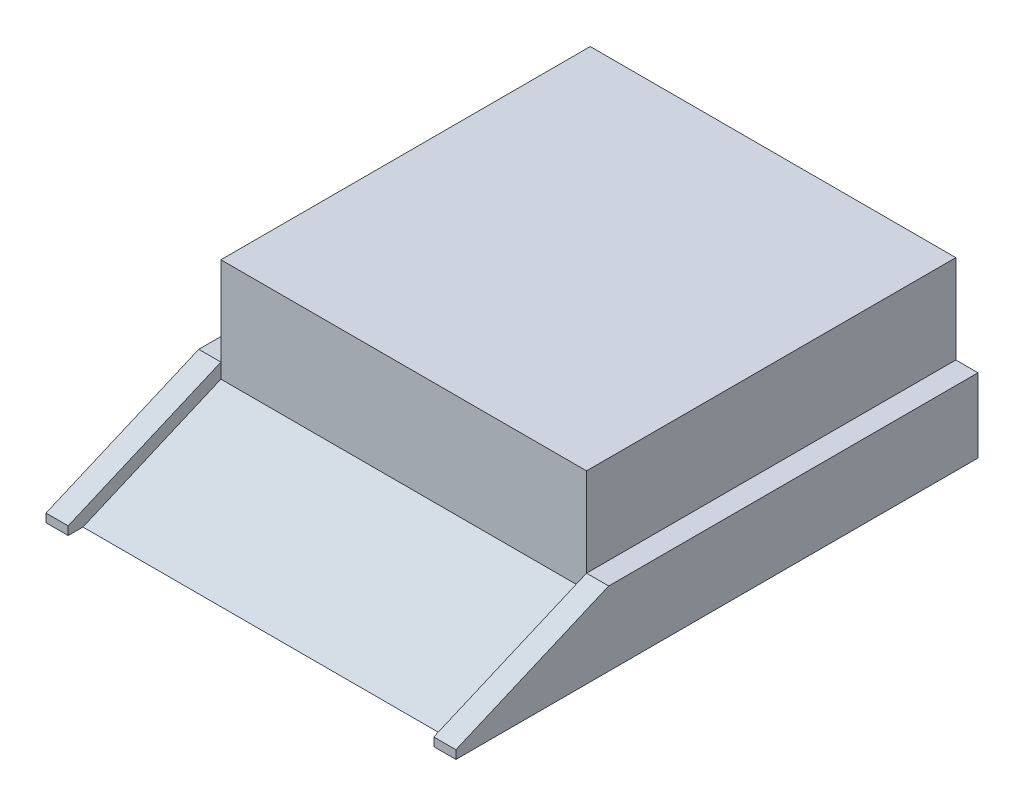
ISO-10303-21;
HEADER;
FILE_DESCRIPTION(('STEP AP214'),'2;1');
FILE_NAME('part.step','',(''),(''),'','','');
FILE_SCHEMA(('AUTOMOTIVE_DESIGN { 1 0 10303 214 1 1 1 1 }'));
ENDSEC;
DATA;
#1=APPLICATION_CONTEXT('core data for automotive mechanical design processes');
#2=APPLICATION_PROTOCOL_DEFINITION('international standard','automotive_design',2000,#1);
#3=PRODUCT_CONTEXT('',#1,'mechanical');
#4=PRODUCT('Part','Part','',(#3));
#5=PRODUCT_RELATED_PRODUCT_CATEGORY('part','',(#4));
#6=PRODUCT_DEFINITION_FORMATION('','',#4);
#7=PRODUCT_DEFINITION_CONTEXT('part definition',#1,'design');
#8=PRODUCT_DEFINITION('design','',#6,#7);
#9=PRODUCT_DEFINITION_SHAPE('','',#8);
#10=(LENGTH_UNIT() NAMED_UNIT(*) SI_UNIT(.MILLI.,.METRE.));
#11=(NAMED_UNIT(*) PLANE_ANGLE_UNIT() SI_UNIT($,.RADIAN.));
#12=(NAMED_UNIT(*) SI_UNIT($,.STERADIAN.) SOLID_ANGLE_UNIT());
#13=UNCERTAINTY_MEASURE_WITH_UNIT(LENGTH_MEASURE(1.E-05),#10,'distance_accuracy_value','');
#14=(GEOMETRIC_REPRESENTATION_CONTEXT(3) GLOBAL_UNCERTAINTY_ASSIGNED_CONTEXT((#13)) GLOBAL_UNIT_ASSIGNED_CONTEXT((#10,
#11,#12)) REPRESENTATION_CONTEXT('',''));
#15=CARTESIAN_POINT('',(0.,0.,0.));
#16=DIRECTION('',(0.,0.,1.));
#17=DIRECTION('',(1.,0.,0.));
#18=AXIS2_PLACEMENT_3D('',#15,#16,#17);
#19=CARTESIAN_POINT('',(-1237.5,0.,0.));
#20=DIRECTION('',(1.,0.,0.));
#21=DIRECTION('',(0.,0.,-1.));
#22=AXIS2_PLACEMENT_3D('',#19,#20,#21);
#23=PLANE('',#22);
#24=DIRECTION('',(0.,-0.393681718866985,0.91924681355441));
#25=VECTOR('',#24,1.);
#26=CARTESIAN_POINT('',(-1237.5,603.271739593706,258.360488048696));
#27=LINE('',#26,#25);
#28=CARTESIAN_POINT('',(-1237.5,400.,733.));
#29=VERTEX_POINT('',#28);
#30=CARTESIAN_POINT('',(-1237.5,0.,1667.));
#31=VERTEX_POINT('',#30);
#32=EDGE_CURVE('E162',#29,#31,#27,.T.);
#33=ORIENTED_EDGE('',*,*,#32,.F.);
#34=DIRECTION('',(0.,-1.,0.));
#35=VECTOR('',#34,1.);
#36=CARTESIAN_POINT('',(-1237.5,1100.,733.));
#37=LINE('',#36,#35);
#38=CARTESIAN_POINT('',(-1237.5,500.,733.));
#39=VERTEX_POINT('',#38);
#40=EDGE_CURVE('E154',#39,#29,#37,.T.);
#41=ORIENTED_EDGE('',*,*,#40,.F.);
#42=DIRECTION('',(0.,-0.393681718866985,0.91924681355441));
#43=VECTOR('',#42,1.);
#44=CARTESIAN_POINT('',(-1237.5,687.7732100167,294.549554611006));
#45=LINE('',#44,#43);
#46=CARTESIAN_POINT('',(-1237.5,57.1734475374734,1767.));
#47=VERTEX_POINT('',#46);
#48=EDGE_CURVE('E166',#39,#47,#45,.T.);
#49=ORIENTED_EDGE('',*,*,#48,.T.);
#50=DIRECTION('',(0.,-1.,0.));
#51=VECTOR('',#50,1.);
#52=CARTESIAN_POINT('',(-1237.5,0.,1767.));
#53=LINE('',#52,#51);
#54=CARTESIAN_POINT('',(-1237.5,0.,1767.));
#55=VERTEX_POINT('',#54);
#56=EDGE_CURVE('E168',#47,#55,#53,.T.);
#57=ORIENTED_EDGE('',*,*,#56,.T.);
#58=DIRECTION('',(0.,0.,-1.));
#59=VECTOR('',#58,1.);
#60=CARTESIAN_POINT('',(-1237.5,0.,0.));
#61=LINE('',#60,#59);
#62=EDGE_CURVE('E170',#55,#31,#61,.T.);
#63=ORIENTED_EDGE('',*,*,#62,.T.);
#64=EDGE_LOOP('',(#33,#41,#49,#57,#63));
#65=FACE_BOUND('',#64,.T.);
#66=ADVANCED_FACE('F34',(#65),#23,.T.);
#67=CARTESIAN_POINT('',(1237.5,0.,0.));
#68=DIRECTION('',(1.,0.,0.));
#69=DIRECTION('',(0.,0.,-1.));
#70=AXIS2_PLACEMENT_3D('',#67,#68,#69);
#71=PLANE('',#70);
#72=DIRECTION('',(0.,1.,0.));
#73=VECTOR('',#72,1.);
#74=CARTESIAN_POINT('',(1237.5,0.,733.));
#75=LINE('',#74,#73);
#76=CARTESIAN_POINT('',(1237.5,400.,733.));
#77=VERTEX_POINT('',#76);
#78=CARTESIAN_POINT('',(1237.5,500.,733.));
#79=VERTEX_POINT('',#78);
#80=EDGE_CURVE('E11',#77,#79,#75,.T.);
#81=ORIENTED_EDGE('',*,*,#80,.F.);
#82=DIRECTION('',(0.,-0.393681718866985,0.91924681355441));
#83=VECTOR('',#82,1.);
#84=CARTESIAN_POINT('',(1237.5,603.271739593706,258.360488048696));
#85=LINE('',#84,#83);
#86=CARTESIAN_POINT('',(1237.5,0.,1667.));
#87=VERTEX_POINT('',#86);
#88=EDGE_CURVE('E153',#77,#87,#85,.T.);
#89=ORIENTED_EDGE('',*,*,#88,.T.);
#90=DIRECTION('',(0.,0.,-1.));
#91=VECTOR('',#90,1.);
#92=CARTESIAN_POINT('',(1237.5,0.,0.));
#93=LINE('',#92,#91);
#94=CARTESIAN_POINT('',(1237.5,0.,1767.));
#95=VERTEX_POINT('',#94);
#96=EDGE_CURVE('E164',#95,#87,#93,.T.);
#97=ORIENTED_EDGE('',*,*,#96,.F.);
#98=DIRECTION('',(0.,-1.,0.));
#99=VECTOR('',#98,1.);
#100=CARTESIAN_POINT('',(1237.5,0.,1767.));
#101=LINE('',#100,#99);
#102=CARTESIAN_POINT('',(1237.5,57.1734475374734,1767.));
#103=VERTEX_POINT('',#102);
#104=EDGE_CURVE('E49',#103,#95,#101,.T.);
#105=ORIENTED_EDGE('',*,*,#104,.F.);
#106=DIRECTION('',(0.,-0.393681718866985,0.91924681355441));
#107=VECTOR('',#106,1.);
#108=CARTESIAN_POINT('',(1237.5,687.7732100167,294.549554611006));
#109=LINE('',#108,#107);
#110=EDGE_CURVE('E175',#79,#103,#109,.T.);
#111=ORIENTED_EDGE('',*,*,#110,.F.);
#112=EDGE_LOOP('',(#81,#89,#97,#105,#111));
#113=FACE_BOUND('',#112,.T.);
#114=ADVANCED_FACE('F258',(#113),#71,.F.);
#115=CARTESIAN_POINT('',(-1387.5,500.,1767.));
#116=DIRECTION('',(0.,0.,-1.));
#117=DIRECTION('',(-1.,0.,0.));
#118=AXIS2_PLACEMENT_3D('',#115,#116,#117);
#119=PLANE('',#118);
#120=ORIENTED_EDGE('',*,*,#56,.F.);
#121=DIRECTION('',(1.,0.,0.));
#122=VECTOR('',#121,1.);
#123=CARTESIAN_POINT('',(-1387.5,57.1734475374734,1767.));
#124=LINE('',#123,#122);
#125=CARTESIAN_POINT('',(-1387.5,57.1734475374734,1767.));
#126=VERTEX_POINT('',#125);
#127=EDGE_CURVE('E188',#126,#47,#124,.T.);
#128=ORIENTED_EDGE('',*,*,#127,.F.);
#129=DIRECTION('',(0.,-1.,0.));
#130=VECTOR('',#129,1.);
#131=CARTESIAN_POINT('',(-1387.5,500.,1767.));
#132=LINE('',#131,#130);
#133=CARTESIAN_POINT('',(-1387.5,0.,1767.));
#134=VERTEX_POINT('',#133);
#135=EDGE_CURVE('E219',#126,#134,#132,.T.);
#136=ORIENTED_EDGE('',*,*,#135,.T.);
#137=DIRECTION('',(1.,0.,0.));
#138=VECTOR('',#137,1.);
#139=CARTESIAN_POINT('',(-1387.5,0.,1767.));
#140=LINE('',#139,#138);
#141=EDGE_CURVE('E199',#134,#55,#140,.T.);
#142=ORIENTED_EDGE('',*,*,#141,.T.);
#143=EDGE_LOOP('',(#120,#128,#136,#142));
#144=FACE_BOUND('',#143,.T.);
#145=ADVANCED_FACE('F256',(#144),#119,.F.);
#146=CARTESIAN_POINT('',(0.,500.,0.));
#147=DIRECTION('',(0.,1.,0.));
#148=DIRECTION('',(0.,0.,1.));
#149=AXIS2_PLACEMENT_3D('',#146,#147,#148);
#150=PLANE('',#149);
#151=DIRECTION('',(1.,0.,0.));
#152=VECTOR('',#151,1.);
#153=CARTESIAN_POINT('',(-1387.5,500.,733.));
#154=LINE('',#153,#152);
#155=CARTESIAN_POINT('',(-1387.5,500.,733.));
#156=VERTEX_POINT('',#155);
#157=EDGE_CURVE('E193',#156,#39,#154,.T.);
#158=ORIENTED_EDGE('',*,*,#157,.T.);
#159=DIRECTION('',(0.,0.,1.));
#160=VECTOR('',#159,1.);
#161=CARTESIAN_POINT('',(-1237.5,500.,0.));
#162=LINE('',#161,#160);
#163=CARTESIAN_POINT('',(-1237.5,500.,-1767.));
#164=VERTEX_POINT('',#163);
#165=EDGE_CURVE('E152',#164,#39,#162,.T.);
#166=ORIENTED_EDGE('',*,*,#165,.F.);
#167=DIRECTION('',(-1.,0.,0.));
#168=VECTOR('',#167,1.);
#169=CARTESIAN_POINT('',(-1387.5,500.,-1767.));
#170=LINE('',#169,#168);
#171=CARTESIAN_POINT('',(-1387.5,500.,-1767.));
#172=VERTEX_POINT('',#171);
#173=EDGE_CURVE('E198',#164,#172,#170,.T.);
#174=ORIENTED_EDGE('',*,*,#173,.T.);
#175=DIRECTION('',(0.,0.,1.));
#176=VECTOR('',#175,1.);
#177=CARTESIAN_POINT('',(-1387.5,500.,-1767.));
#178=LINE('',#177,#176);
#179=EDGE_CURVE('E203',#172,#156,#178,.T.);
#180=ORIENTED_EDGE('',*,*,#179,.T.);
#181=EDGE_LOOP('',(#158,#166,#174,#180));
#182=FACE_BOUND('',#181,.T.);
#183=ADVANCED_FACE('F247',(#182),#150,.T.);
#184=CARTESIAN_POINT('',(-1387.5,500.,-1767.));
#185=DIRECTION('',(0.,0.,1.));
#186=DIRECTION('',(1.,0.,0.));
#187=AXIS2_PLACEMENT_3D('',#184,#185,#186);
#188=PLANE('',#187);
#189=DIRECTION('',(-1.,0.,0.));
#190=VECTOR('',#189,1.);
#191=CARTESIAN_POINT('',(-1387.5,0.,-1767.));
#192=LINE('',#191,#190);
#193=CARTESIAN_POINT('',(1387.5,0.,-1767.));
#194=VERTEX_POINT('',#193);
#195=CARTESIAN_POINT('',(-1387.5,0.,-1767.));
#196=VERTEX_POINT('',#195);
#197=EDGE_CURVE('E209',#194,#196,#192,.T.);
#198=ORIENTED_EDGE('',*,*,#197,.T.);
#199=DIRECTION('',(0.,-1.,0.));
#200=VECTOR('',#199,1.);
#201=CARTESIAN_POINT('',(-1387.5,500.,-1767.));
#202=LINE('',#201,#200);
#203=EDGE_CURVE('E221',#172,#196,#202,.T.);
#204=ORIENTED_EDGE('',*,*,#203,.F.);
#205=ORIENTED_EDGE('',*,*,#173,.F.);
#206=DIRECTION('',(0.,-1.,0.));
#207=VECTOR('',#206,1.);
#208=CARTESIAN_POINT('',(-1237.5,1100.,-1767.));
#209=LINE('',#208,#207);
#210=CARTESIAN_POINT('',(-1237.5,1100.,-1767.));
#211=VERTEX_POINT('',#210);
#212=EDGE_CURVE('E245',#211,#164,#209,.T.);
#213=ORIENTED_EDGE('',*,*,#212,.F.);
#214=DIRECTION('',(-1.,0.,0.));
#215=VECTOR('',#214,1.);
#216=CARTESIAN_POINT('',(0.,1100.,-1767.));
#217=LINE('',#216,#215);
#218=CARTESIAN_POINT('',(1237.5,1100.,-1767.));
#219=VERTEX_POINT('',#218);
#220=EDGE_CURVE('E146',#219,#211,#217,.T.);
#221=ORIENTED_EDGE('',*,*,#220,.F.);
#222=DIRECTION('',(0.,-1.,0.));
#223=VECTOR('',#222,1.);
#224=CARTESIAN_POINT('',(1237.5,1100.,-1767.));
#225=LINE('',#224,#223);
#226=CARTESIAN_POINT('',(1237.5,500.,-1767.));
#227=VERTEX_POINT('',#226);
#228=EDGE_CURVE('E366',#219,#227,#225,.T.);
#229=ORIENTED_EDGE('',*,*,#228,.T.);
#230=CARTESIAN_POINT('',(1387.5,500.,-1767.));
#231=VERTEX_POINT('',#230);
#232=EDGE_CURVE('E200',#231,#227,#170,.T.);
#233=ORIENTED_EDGE('',*,*,#232,.F.);
#234=DIRECTION('',(0.,-1.,0.));
#235=VECTOR('',#234,1.);
#236=CARTESIAN_POINT('',(1387.5,500.,-1767.));
#237=LINE('',#236,#235);
#238=EDGE_CURVE('E42',#231,#194,#237,.T.);
#239=ORIENTED_EDGE('',*,*,#238,.T.);
#240=EDGE_LOOP('',(#198,#204,#205,#213,#221,#229,#233,#239));
#241=FACE_BOUND('',#240,.T.);
#242=ADVANCED_FACE('F227',(#241),#188,.F.);
#243=CARTESIAN_POINT('',(0.,0.,0.));
#244=DIRECTION('',(0.,1.,0.));
#245=DIRECTION('',(0.,0.,1.));
#246=AXIS2_PLACEMENT_3D('',#243,#244,#245);
#247=PLANE('',#246);
#248=DIRECTION('',(0.,0.,1.));
#249=VECTOR('',#248,1.);
#250=CARTESIAN_POINT('',(-1387.5,0.,-1767.));
#251=LINE('',#250,#249);
#252=EDGE_CURVE('E211',#196,#134,#251,.T.);
#253=ORIENTED_EDGE('',*,*,#252,.F.);
#254=ORIENTED_EDGE('',*,*,#197,.F.);
#255=DIRECTION('',(0.,0.,-1.));
#256=VECTOR('',#255,1.);
#257=CARTESIAN_POINT('',(1387.5,0.,-1767.));
#258=LINE('',#257,#256);
#259=CARTESIAN_POINT('',(1387.5,0.,1767.));
#260=VERTEX_POINT('',#259);
#261=EDGE_CURVE('E191',#260,#194,#258,.T.);
#262=ORIENTED_EDGE('',*,*,#261,.F.);
#263=EDGE_CURVE('E214',#95,#260,#140,.T.);
#264=ORIENTED_EDGE('',*,*,#263,.F.);
#265=ORIENTED_EDGE('',*,*,#96,.T.);
#266=DIRECTION('',(1.,0.,0.));
#267=VECTOR('',#266,1.);
#268=CARTESIAN_POINT('',(-1237.5,0.,1667.));
#269=LINE('',#268,#267);
#270=EDGE_CURVE('E180',#31,#87,#269,.T.);
#271=ORIENTED_EDGE('',*,*,#270,.F.);
#272=ORIENTED_EDGE('',*,*,#62,.F.);
#273=ORIENTED_EDGE('',*,*,#141,.F.);
#274=EDGE_LOOP('',(#253,#254,#262,#264,#265,#271,#272,#273));
#275=FACE_BOUND('',#274,.T.);
#276=ADVANCED_FACE('F236',(#275),#247,.F.);
#277=CARTESIAN_POINT('',(-1387.5,687.7732100167,294.549554611006));
#278=DIRECTION('',(0.,0.91924681355441,0.393681718866985));
#279=DIRECTION('',(0.,-0.393681718866985,0.91924681355441));
#280=AXIS2_PLACEMENT_3D('',#277,#278,#279);
#281=PLANE('',#280);
#282=ORIENTED_EDGE('',*,*,#127,.T.);
#283=ORIENTED_EDGE('',*,*,#48,.F.);
#284=ORIENTED_EDGE('',*,*,#157,.F.);
#285=DIRECTION('',(0.,-0.393681718866985,0.91924681355441));
#286=VECTOR('',#285,1.);
#287=CARTESIAN_POINT('',(-1387.5,687.7732100167,294.549554611006));
#288=LINE('',#287,#286);
#289=EDGE_CURVE('E184',#156,#126,#288,.T.);
#290=ORIENTED_EDGE('',*,*,#289,.T.);
#291=EDGE_LOOP('',(#282,#283,#284,#290));
#292=FACE_BOUND('',#291,.T.);
#293=ADVANCED_FACE('F250',(#292),#281,.T.);
#294=CARTESIAN_POINT('',(1387.5,500.,-1767.));
#295=DIRECTION('',(-1.,0.,0.));
#296=DIRECTION('',(0.,0.,1.));
#297=AXIS2_PLACEMENT_3D('',#294,#295,#296);
#298=PLANE('',#297);
#299=DIRECTION('',(0.,-0.393681718866985,0.91924681355441));
#300=VECTOR('',#299,1.);
#301=CARTESIAN_POINT('',(1387.5,687.7732100167,294.549554611006));
#302=LINE('',#301,#300);
#303=CARTESIAN_POINT('',(1387.5,500.,733.));
#304=VERTEX_POINT('',#303);
#305=CARTESIAN_POINT('',(1387.5,57.1734475374734,1767.));
#306=VERTEX_POINT('',#305);
#307=EDGE_CURVE('E182',#304,#306,#302,.T.);
#308=ORIENTED_EDGE('',*,*,#307,.T.);
#309=DIRECTION('',(0.,-1.,0.));
#310=VECTOR('',#309,1.);
#311=CARTESIAN_POINT('',(1387.5,500.,1767.));
#312=LINE('',#311,#310);
#313=EDGE_CURVE('E206',#306,#260,#312,.T.);
#314=ORIENTED_EDGE('',*,*,#313,.T.);
#315=ORIENTED_EDGE('',*,*,#261,.T.);
#316=ORIENTED_EDGE('',*,*,#238,.F.);
#317=DIRECTION('',(0.,0.,-1.));
#318=VECTOR('',#317,1.);
#319=CARTESIAN_POINT('',(1387.5,500.,-1767.));
#320=LINE('',#319,#318);
#321=EDGE_CURVE('E196',#304,#231,#320,.T.);
#322=ORIENTED_EDGE('',*,*,#321,.F.);
#323=EDGE_LOOP('',(#308,#314,#315,#316,#322));
#324=FACE_BOUND('',#323,.T.);
#325=ADVANCED_FACE('F36',(#324),#298,.F.);
#326=CARTESIAN_POINT('',(-1387.5,500.,-1767.));
#327=DIRECTION('',(1.,0.,0.));
#328=DIRECTION('',(0.,0.,-1.));
#329=AXIS2_PLACEMENT_3D('',#326,#327,#328);
#330=PLANE('',#329);
#331=ORIENTED_EDGE('',*,*,#289,.F.);
#332=ORIENTED_EDGE('',*,*,#179,.F.);
#333=ORIENTED_EDGE('',*,*,#203,.T.);
#334=ORIENTED_EDGE('',*,*,#252,.T.);
#335=ORIENTED_EDGE('',*,*,#135,.F.);
#336=EDGE_LOOP('',(#331,#332,#333,#334,#335));
#337=FACE_BOUND('',#336,.T.);
#338=ADVANCED_FACE('F242',(#337),#330,.F.);
#339=EDGE_CURVE('E192',#103,#306,#124,.T.);
#340=ORIENTED_EDGE('',*,*,#339,.F.);
#341=ORIENTED_EDGE('',*,*,#104,.T.);
#342=ORIENTED_EDGE('',*,*,#263,.T.);
#343=ORIENTED_EDGE('',*,*,#313,.F.);
#344=EDGE_LOOP('',(#340,#341,#342,#343));
#345=FACE_BOUND('',#344,.T.);
#346=ADVANCED_FACE('F260',(#345),#119,.F.);
#347=DIRECTION('',(0.,0.,1.));
#348=VECTOR('',#347,1.);
#349=CARTESIAN_POINT('',(1237.5,500.,0.));
#350=LINE('',#349,#348);
#351=EDGE_CURVE('E157',#227,#79,#350,.T.);
#352=ORIENTED_EDGE('',*,*,#351,.T.);
#353=EDGE_CURVE('E57',#79,#304,#154,.T.);
#354=ORIENTED_EDGE('',*,*,#353,.T.);
#355=ORIENTED_EDGE('',*,*,#321,.T.);
#356=ORIENTED_EDGE('',*,*,#232,.T.);
#357=EDGE_LOOP('',(#352,#354,#355,#356));
#358=FACE_BOUND('',#357,.T.);
#359=ADVANCED_FACE('F266',(#358),#150,.T.);
#360=ORIENTED_EDGE('',*,*,#110,.T.);
#361=ORIENTED_EDGE('',*,*,#339,.T.);
#362=ORIENTED_EDGE('',*,*,#307,.F.);
#363=ORIENTED_EDGE('',*,*,#353,.F.);
#364=EDGE_LOOP('',(#360,#361,#362,#363));
#365=FACE_BOUND('',#364,.T.);
#366=ADVANCED_FACE('F282',(#365),#281,.T.);
#367=CARTESIAN_POINT('',(-1237.5,603.271739593706,258.360488048696));
#368=DIRECTION('',(0.,0.91924681355441,0.393681718866985));
#369=DIRECTION('',(0.,-0.393681718866985,0.91924681355441));
#370=AXIS2_PLACEMENT_3D('',#367,#368,#369);
#371=PLANE('',#370);
#372=ORIENTED_EDGE('',*,*,#88,.F.);
#373=DIRECTION('',(1.,0.,0.));
#374=VECTOR('',#373,1.);
#375=CARTESIAN_POINT('',(-1237.5,400.,733.));
#376=LINE('',#375,#374);
#377=EDGE_CURVE('E172',#29,#77,#376,.T.);
#378=ORIENTED_EDGE('',*,*,#377,.F.);
#379=ORIENTED_EDGE('',*,*,#32,.T.);
#380=ORIENTED_EDGE('',*,*,#270,.T.);
#381=EDGE_LOOP('',(#372,#378,#379,#380));
#382=FACE_BOUND('',#381,.T.);
#383=ADVANCED_FACE('F279',(#382),#371,.T.);
#384=CARTESIAN_POINT('',(-1237.5,1100.,1.35693925231964E-13));
#385=DIRECTION('',(1.,0.,0.));
#386=DIRECTION('',(0.,0.,-1.));
#387=AXIS2_PLACEMENT_3D('',#384,#385,#386);
#388=PLANE('',#387);
#389=ORIENTED_EDGE('',*,*,#165,.T.);
#390=CARTESIAN_POINT('',(-1237.5,1100.,733.));
#391=VERTEX_POINT('',#390);
#392=EDGE_CURVE('E134',#391,#39,#37,.T.);
#393=ORIENTED_EDGE('',*,*,#392,.F.);
#394=DIRECTION('',(0.,0.,1.));
#395=VECTOR('',#394,1.);
#396=CARTESIAN_POINT('',(-1237.5,1100.,1.35693925231964E-13));
#397=LINE('',#396,#395);
#398=EDGE_CURVE('E141',#211,#391,#397,.T.);
#399=ORIENTED_EDGE('',*,*,#398,.F.);
#400=ORIENTED_EDGE('',*,*,#212,.T.);
#401=EDGE_LOOP('',(#389,#393,#399,#400));
#402=FACE_BOUND('',#401,.T.);
#403=ADVANCED_FACE('F150',(#402),#388,.F.);
#404=CARTESIAN_POINT('',(0.,1100.,733.));
#405=DIRECTION('',(0.,0.,-1.));
#406=DIRECTION('',(0.,1.,0.));
#407=AXIS2_PLACEMENT_3D('',#404,#405,#406);
#408=PLANE('',#407);
#409=ORIENTED_EDGE('',*,*,#377,.T.);
#410=ORIENTED_EDGE('',*,*,#80,.T.);
#411=DIRECTION('',(0.,-1.,0.));
#412=VECTOR('',#411,1.);
#413=CARTESIAN_POINT('',(1237.5,1100.,733.));
#414=LINE('',#413,#412);
#415=CARTESIAN_POINT('',(1237.5,1100.,733.));
#416=VERTEX_POINT('',#415);
#417=EDGE_CURVE('E137',#416,#79,#414,.T.);
#418=ORIENTED_EDGE('',*,*,#417,.F.);
#419=DIRECTION('',(1.,0.,0.));
#420=VECTOR('',#419,1.);
#421=CARTESIAN_POINT('',(0.,1100.,733.));
#422=LINE('',#421,#420);
#423=EDGE_CURVE('E130',#391,#416,#422,.T.);
#424=ORIENTED_EDGE('',*,*,#423,.F.);
#425=ORIENTED_EDGE('',*,*,#392,.T.);
#426=ORIENTED_EDGE('',*,*,#40,.T.);
#427=EDGE_LOOP('',(#409,#410,#418,#424,#425,#426));
#428=FACE_BOUND('',#427,.T.);
#429=ADVANCED_FACE('F132',(#428),#408,.F.);
#430=CARTESIAN_POINT('',(1237.5,1100.,1.35693925231964E-13));
#431=DIRECTION('',(-1.,0.,0.));
#432=DIRECTION('',(0.,0.,1.));
#433=AXIS2_PLACEMENT_3D('',#430,#431,#432);
#434=PLANE('',#433);
#435=ORIENTED_EDGE('',*,*,#351,.F.);
#436=ORIENTED_EDGE('',*,*,#228,.F.);
#437=DIRECTION('',(0.,0.,-1.));
#438=VECTOR('',#437,1.);
#439=CARTESIAN_POINT('',(1237.5,1100.,1.35693925231964E-13));
#440=LINE('',#439,#438);
#441=EDGE_CURVE('E140',#416,#219,#440,.T.);
#442=ORIENTED_EDGE('',*,*,#441,.F.);
#443=ORIENTED_EDGE('',*,*,#417,.T.);
#444=EDGE_LOOP('',(#435,#436,#442,#443));
#445=FACE_BOUND('',#444,.T.);
#446=ADVANCED_FACE('F344',(#445),#434,.F.);
#447=CARTESIAN_POINT('',(0.,1100.,1.35693925231964E-13));
#448=DIRECTION('',(0.,1.,0.));
#449=DIRECTION('',(0.,0.,1.));
#450=AXIS2_PLACEMENT_3D('',#447,#448,#449);
#451=PLANE('',#450);
#452=ORIENTED_EDGE('',*,*,#398,.T.);
#453=ORIENTED_EDGE('',*,*,#423,.T.);
#454=ORIENTED_EDGE('',*,*,#441,.T.);
#455=ORIENTED_EDGE('',*,*,#220,.T.);
#456=EDGE_LOOP('',(#452,#453,#454,#455));
#457=FACE_BOUND('',#456,.T.);
#458=ADVANCED_FACE('F144',(#457),#451,.T.);
#459=CLOSED_SHELL('',(#66,#114,#145,#183,#242,#276,#293,#325,#338,#346,#359,#366,#383,#403,#429,
#446,#458));
#460=MANIFOLD_SOLID_BREP('B2',#459);
#461=ADVANCED_BREP_SHAPE_REPRESENTATION('',(#18,#460),#14);
#462=SHAPE_DEFINITION_REPRESENTATION(#9,#461);
ENDSEC;
END-ISO-10303-21;
